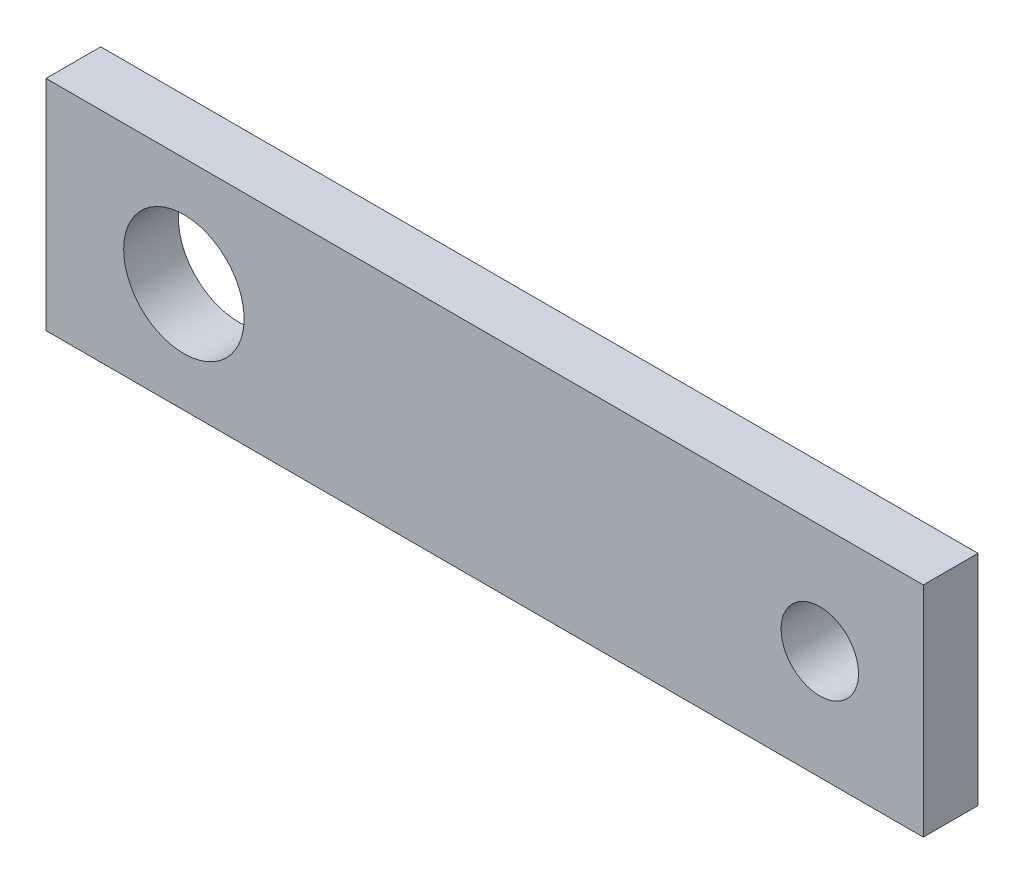
ISO-10303-21;
HEADER;
FILE_DESCRIPTION(('STEP AP214'),'2;1');
FILE_NAME('part.step','',(''),(''),'','','');
FILE_SCHEMA(('AUTOMOTIVE_DESIGN { 1 0 10303 214 1 1 1 1 }'));
ENDSEC;
DATA;
#1=APPLICATION_CONTEXT('core data for automotive mechanical design processes');
#2=APPLICATION_PROTOCOL_DEFINITION('international standard','automotive_design',2000,#1);
#3=PRODUCT_CONTEXT('',#1,'mechanical');
#4=PRODUCT('Part','Part','',(#3));
#5=PRODUCT_RELATED_PRODUCT_CATEGORY('part','',(#4));
#6=PRODUCT_DEFINITION_FORMATION('','',#4);
#7=PRODUCT_DEFINITION_CONTEXT('part definition',#1,'design');
#8=PRODUCT_DEFINITION('design','',#6,#7);
#9=PRODUCT_DEFINITION_SHAPE('','',#8);
#10=(LENGTH_UNIT() NAMED_UNIT(*) SI_UNIT(.MILLI.,.METRE.));
#11=(NAMED_UNIT(*) PLANE_ANGLE_UNIT() SI_UNIT($,.RADIAN.));
#12=(NAMED_UNIT(*) SI_UNIT($,.STERADIAN.) SOLID_ANGLE_UNIT());
#13=UNCERTAINTY_MEASURE_WITH_UNIT(LENGTH_MEASURE(1.E-05),#10,'distance_accuracy_value','');
#14=(GEOMETRIC_REPRESENTATION_CONTEXT(3) GLOBAL_UNCERTAINTY_ASSIGNED_CONTEXT((#13)) GLOBAL_UNIT_ASSIGNED_CONTEXT((#10,
#11,#12)) REPRESENTATION_CONTEXT('',''));
#15=CARTESIAN_POINT('',(0.,0.,0.));
#16=DIRECTION('',(0.,0.,1.));
#17=DIRECTION('',(1.,0.,0.));
#18=AXIS2_PLACEMENT_3D('',#15,#16,#17);
#19=CARTESIAN_POINT('',(-25.5,6.35,-3.18));
#20=DIRECTION('',(-1.,0.,0.));
#21=DIRECTION('',(0.,0.,1.));
#22=AXIS2_PLACEMENT_3D('',#19,#20,#21);
#23=PLANE('',#22);
#24=DIRECTION('',(0.,-1.,0.));
#25=VECTOR('',#24,1.);
#26=CARTESIAN_POINT('',(-25.5,6.35,0.));
#27=LINE('',#26,#25);
#28=CARTESIAN_POINT('',(-25.5,6.35,0.));
#29=VERTEX_POINT('',#28);
#30=CARTESIAN_POINT('',(-25.5,-6.35,0.));
#31=VERTEX_POINT('',#30);
#32=EDGE_CURVE('E107',#29,#31,#27,.T.);
#33=ORIENTED_EDGE('',*,*,#32,.F.);
#34=DIRECTION('',(0.,0.,1.));
#35=VECTOR('',#34,1.);
#36=CARTESIAN_POINT('',(-25.5,6.35,-3.18));
#37=LINE('',#36,#35);
#38=CARTESIAN_POINT('',(-25.5,6.35,-3.18));
#39=VERTEX_POINT('',#38);
#40=EDGE_CURVE('E11',#39,#29,#37,.T.);
#41=ORIENTED_EDGE('',*,*,#40,.F.);
#42=DIRECTION('',(0.,-1.,0.));
#43=VECTOR('',#42,1.);
#44=CARTESIAN_POINT('',(-25.5,6.35,-3.18));
#45=LINE('',#44,#43);
#46=CARTESIAN_POINT('',(-25.5,-6.35,-3.18));
#47=VERTEX_POINT('',#46);
#48=EDGE_CURVE('E100',#39,#47,#45,.T.);
#49=ORIENTED_EDGE('',*,*,#48,.T.);
#50=DIRECTION('',(0.,0.,1.));
#51=VECTOR('',#50,1.);
#52=CARTESIAN_POINT('',(-25.5,-6.35,-3.18));
#53=LINE('',#52,#51);
#54=EDGE_CURVE('E83',#47,#31,#53,.T.);
#55=ORIENTED_EDGE('',*,*,#54,.T.);
#56=EDGE_LOOP('',(#33,#41,#49,#55));
#57=FACE_BOUND('',#56,.T.);
#58=ADVANCED_FACE('F40',(#57),#23,.T.);
#59=CARTESIAN_POINT('',(25.5,6.35,-3.18));
#60=DIRECTION('',(0.,1.,0.));
#61=DIRECTION('',(-1.,0.,0.));
#62=AXIS2_PLACEMENT_3D('',#59,#60,#61);
#63=PLANE('',#62);
#64=DIRECTION('',(-1.,0.,0.));
#65=VECTOR('',#64,1.);
#66=CARTESIAN_POINT('',(25.5,6.35,0.));
#67=LINE('',#66,#65);
#68=CARTESIAN_POINT('',(25.5,6.35,0.));
#69=VERTEX_POINT('',#68);
#70=EDGE_CURVE('E102',#69,#29,#67,.T.);
#71=ORIENTED_EDGE('',*,*,#70,.F.);
#72=DIRECTION('',(0.,0.,1.));
#73=VECTOR('',#72,1.);
#74=CARTESIAN_POINT('',(25.5,6.35,-3.18));
#75=LINE('',#74,#73);
#76=CARTESIAN_POINT('',(25.5,6.35,-3.18));
#77=VERTEX_POINT('',#76);
#78=EDGE_CURVE('E49',#77,#69,#75,.T.);
#79=ORIENTED_EDGE('',*,*,#78,.F.);
#80=DIRECTION('',(-1.,0.,0.));
#81=VECTOR('',#80,1.);
#82=CARTESIAN_POINT('',(25.5,6.35,-3.18));
#83=LINE('',#82,#81);
#84=EDGE_CURVE('E97',#77,#39,#83,.T.);
#85=ORIENTED_EDGE('',*,*,#84,.T.);
#86=ORIENTED_EDGE('',*,*,#40,.T.);
#87=EDGE_LOOP('',(#71,#79,#85,#86));
#88=FACE_BOUND('',#87,.T.);
#89=ADVANCED_FACE('F145',(#88),#63,.T.);
#90=CARTESIAN_POINT('',(25.5,6.35,-3.18));
#91=DIRECTION('',(1.,0.,0.));
#92=DIRECTION('',(0.,0.,-1.));
#93=AXIS2_PLACEMENT_3D('',#90,#91,#92);
#94=PLANE('',#93);
#95=DIRECTION('',(0.,1.,0.));
#96=VECTOR('',#95,1.);
#97=CARTESIAN_POINT('',(25.5,6.35,0.));
#98=LINE('',#97,#96);
#99=CARTESIAN_POINT('',(25.5,-6.35,0.));
#100=VERTEX_POINT('',#99);
#101=EDGE_CURVE('E91',#100,#69,#98,.T.);
#102=ORIENTED_EDGE('',*,*,#101,.F.);
#103=DIRECTION('',(0.,0.,1.));
#104=VECTOR('',#103,1.);
#105=CARTESIAN_POINT('',(25.5,-6.35,-3.18));
#106=LINE('',#105,#104);
#107=CARTESIAN_POINT('',(25.5,-6.35,-3.18));
#108=VERTEX_POINT('',#107);
#109=EDGE_CURVE('E86',#108,#100,#106,.T.);
#110=ORIENTED_EDGE('',*,*,#109,.F.);
#111=DIRECTION('',(0.,1.,0.));
#112=VECTOR('',#111,1.);
#113=CARTESIAN_POINT('',(25.5,6.35,-3.18));
#114=LINE('',#113,#112);
#115=EDGE_CURVE('E89',#108,#77,#114,.T.);
#116=ORIENTED_EDGE('',*,*,#115,.T.);
#117=ORIENTED_EDGE('',*,*,#78,.T.);
#118=EDGE_LOOP('',(#102,#110,#116,#117));
#119=FACE_BOUND('',#118,.T.);
#120=ADVANCED_FACE('F88',(#119),#94,.T.);
#121=CARTESIAN_POINT('',(25.5,-6.35,-3.18));
#122=DIRECTION('',(0.,-1.,0.));
#123=DIRECTION('',(1.,0.,0.));
#124=AXIS2_PLACEMENT_3D('',#121,#122,#123);
#125=PLANE('',#124);
#126=DIRECTION('',(1.,0.,0.));
#127=VECTOR('',#126,1.);
#128=CARTESIAN_POINT('',(25.5,-6.35,0.));
#129=LINE('',#128,#127);
#130=EDGE_CURVE('E110',#31,#100,#129,.T.);
#131=ORIENTED_EDGE('',*,*,#130,.F.);
#132=ORIENTED_EDGE('',*,*,#54,.F.);
#133=DIRECTION('',(1.,0.,0.));
#134=VECTOR('',#133,1.);
#135=CARTESIAN_POINT('',(25.5,-6.35,-3.18));
#136=LINE('',#135,#134);
#137=EDGE_CURVE('E96',#47,#108,#136,.T.);
#138=ORIENTED_EDGE('',*,*,#137,.T.);
#139=ORIENTED_EDGE('',*,*,#109,.T.);
#140=EDGE_LOOP('',(#131,#132,#138,#139));
#141=FACE_BOUND('',#140,.T.);
#142=ADVANCED_FACE('F99',(#141),#125,.T.);
#143=CARTESIAN_POINT('',(0.,0.,-3.18));
#144=DIRECTION('',(0.,0.,-1.));
#145=DIRECTION('',(-1.,0.,0.));
#146=AXIS2_PLACEMENT_3D('',#143,#144,#145);
#147=PLANE('',#146);
#148=CARTESIAN_POINT('',(-17.4849999999995,1.06926114114465E-13,-3.18));
#149=DIRECTION('',(0.,0.,-1.));
#150=DIRECTION('',(-1.,0.,0.));
#151=AXIS2_PLACEMENT_3D('',#148,#149,#150);
#152=CIRCLE('',#151,3.5);
#153=CARTESIAN_POINT('',(-20.9849999999995,1.06926114114465E-13,-3.18));
#154=VERTEX_POINT('',#153);
#155=EDGE_CURVE('E118',#154,#154,#152,.T.);
#156=ORIENTED_EDGE('',*,*,#155,.F.);
#157=EDGE_LOOP('',(#156));
#158=FACE_BOUND('',#157,.T.);
#159=CARTESIAN_POINT('',(19.4824999999999,0.,-3.18));
#160=DIRECTION('',(0.,0.,-1.));
#161=DIRECTION('',(-1.,0.,0.));
#162=AXIS2_PLACEMENT_3D('',#159,#160,#161);
#163=CIRCLE('',#162,2.25);
#164=CARTESIAN_POINT('',(17.2324999999999,0.,-3.18));
#165=VERTEX_POINT('',#164);
#166=EDGE_CURVE('E123',#165,#165,#163,.T.);
#167=ORIENTED_EDGE('',*,*,#166,.F.);
#168=EDGE_LOOP('',(#167));
#169=FACE_BOUND('',#168,.T.);
#170=ORIENTED_EDGE('',*,*,#48,.F.);
#171=ORIENTED_EDGE('',*,*,#84,.F.);
#172=ORIENTED_EDGE('',*,*,#115,.F.);
#173=ORIENTED_EDGE('',*,*,#137,.F.);
#174=EDGE_LOOP('',(#170,#171,#172,#173));
#175=FACE_BOUND('',#174,.T.);
#176=ADVANCED_FACE('F95',(#158,#169,#175),#147,.T.);
#177=CARTESIAN_POINT('',(0.,0.,0.));
#178=DIRECTION('',(0.,0.,-1.));
#179=DIRECTION('',(-1.,0.,0.));
#180=AXIS2_PLACEMENT_3D('',#177,#178,#179);
#181=PLANE('',#180);
#182=CARTESIAN_POINT('',(-17.4849999999995,1.06926114114465E-13,0.));
#183=DIRECTION('',(0.,0.,-1.));
#184=DIRECTION('',(-1.,0.,0.));
#185=AXIS2_PLACEMENT_3D('',#182,#183,#184);
#186=CIRCLE('',#185,3.5);
#187=CARTESIAN_POINT('',(-20.9849999999995,1.06926114114465E-13,0.));
#188=VERTEX_POINT('',#187);
#189=EDGE_CURVE('E43',#188,#188,#186,.T.);
#190=ORIENTED_EDGE('',*,*,#189,.T.);
#191=EDGE_LOOP('',(#190));
#192=FACE_BOUND('',#191,.T.);
#193=CARTESIAN_POINT('',(19.4824999999999,0.,0.));
#194=DIRECTION('',(0.,0.,-1.));
#195=DIRECTION('',(-1.,0.,0.));
#196=AXIS2_PLACEMENT_3D('',#193,#194,#195);
#197=CIRCLE('',#196,2.25);
#198=CARTESIAN_POINT('',(17.2324999999999,0.,0.));
#199=VERTEX_POINT('',#198);
#200=EDGE_CURVE('E116',#199,#199,#197,.T.);
#201=ORIENTED_EDGE('',*,*,#200,.T.);
#202=EDGE_LOOP('',(#201));
#203=FACE_BOUND('',#202,.T.);
#204=ORIENTED_EDGE('',*,*,#32,.T.);
#205=ORIENTED_EDGE('',*,*,#130,.T.);
#206=ORIENTED_EDGE('',*,*,#101,.T.);
#207=ORIENTED_EDGE('',*,*,#70,.T.);
#208=EDGE_LOOP('',(#204,#205,#206,#207));
#209=FACE_BOUND('',#208,.T.);
#210=ADVANCED_FACE('F134',(#192,#203,#209),#181,.F.);
#211=CARTESIAN_POINT('',(19.4824999999999,0.,6.82));
#212=DIRECTION('',(0.,0.,-1.));
#213=DIRECTION('',(-1.,0.,0.));
#214=AXIS2_PLACEMENT_3D('',#211,#212,#213);
#215=CYLINDRICAL_SURFACE('',#214,2.25);
#216=ORIENTED_EDGE('',*,*,#166,.T.);
#217=EDGE_LOOP('',(#216));
#218=FACE_BOUND('',#217,.T.);
#219=ORIENTED_EDGE('',*,*,#200,.F.);
#220=EDGE_LOOP('',(#219));
#221=FACE_BOUND('',#220,.T.);
#222=ADVANCED_FACE('F130',(#218,#221),#215,.F.);
#223=CARTESIAN_POINT('',(-17.4849999999995,1.06926114114465E-13,6.82));
#224=DIRECTION('',(0.,0.,-1.));
#225=DIRECTION('',(-1.,0.,0.));
#226=AXIS2_PLACEMENT_3D('',#223,#224,#225);
#227=CYLINDRICAL_SURFACE('',#226,3.5);
#228=ORIENTED_EDGE('',*,*,#155,.T.);
#229=EDGE_LOOP('',(#228));
#230=FACE_BOUND('',#229,.T.);
#231=ORIENTED_EDGE('',*,*,#189,.F.);
#232=EDGE_LOOP('',(#231));
#233=FACE_BOUND('',#232,.T.);
#234=ADVANCED_FACE('F183',(#230,#233),#227,.F.);
#235=CLOSED_SHELL('',(#58,#89,#120,#142,#176,#210,#222,#234));
#236=MANIFOLD_SOLID_BREP('B2',#235);
#237=ADVANCED_BREP_SHAPE_REPRESENTATION('',(#18,#236),#14);
#238=SHAPE_DEFINITION_REPRESENTATION(#9,#237);
ENDSEC;
END-ISO-10303-21;
